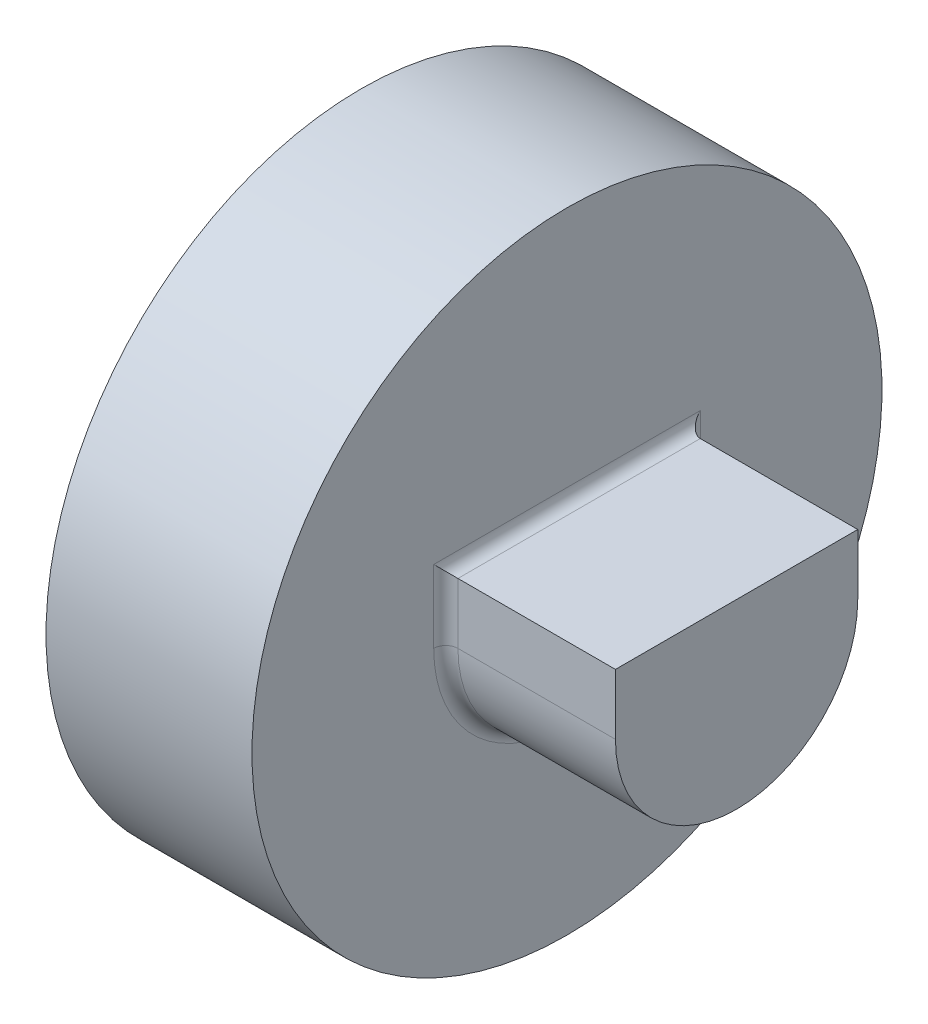
ISO-10303-21;
HEADER;
FILE_DESCRIPTION(('STEP AP214'),'2;1');
FILE_NAME('part.step','',(''),(''),'','','');
FILE_SCHEMA(('AUTOMOTIVE_DESIGN { 1 0 10303 214 1 1 1 1 }'));
ENDSEC;
DATA;
#1=APPLICATION_CONTEXT('core data for automotive mechanical design processes');
#2=APPLICATION_PROTOCOL_DEFINITION('international standard','automotive_design',2000,#1);
#3=PRODUCT_CONTEXT('',#1,'mechanical');
#4=PRODUCT('Part','Part','',(#3));
#5=PRODUCT_RELATED_PRODUCT_CATEGORY('part','',(#4));
#6=PRODUCT_DEFINITION_FORMATION('','',#4);
#7=PRODUCT_DEFINITION_CONTEXT('part definition',#1,'design');
#8=PRODUCT_DEFINITION('design','',#6,#7);
#9=PRODUCT_DEFINITION_SHAPE('','',#8);
#10=(LENGTH_UNIT() NAMED_UNIT(*) SI_UNIT(.MILLI.,.METRE.));
#11=(NAMED_UNIT(*) PLANE_ANGLE_UNIT() SI_UNIT($,.RADIAN.));
#12=(NAMED_UNIT(*) SI_UNIT($,.STERADIAN.) SOLID_ANGLE_UNIT());
#13=UNCERTAINTY_MEASURE_WITH_UNIT(LENGTH_MEASURE(1.E-05),#10,'distance_accuracy_value','');
#14=(GEOMETRIC_REPRESENTATION_CONTEXT(3) GLOBAL_UNCERTAINTY_ASSIGNED_CONTEXT((#13)) GLOBAL_UNIT_ASSIGNED_CONTEXT((#10,
#11,#12)) REPRESENTATION_CONTEXT('',''));
#15=CARTESIAN_POINT('',(0.,0.,0.));
#16=DIRECTION('',(0.,0.,1.));
#17=DIRECTION('',(1.,0.,0.));
#18=AXIS2_PLACEMENT_3D('',#15,#16,#17);
#19=CARTESIAN_POINT('',(-1.5,11.,0.));
#20=DIRECTION('',(1.,0.,0.));
#21=DIRECTION('',(0.,1.,0.));
#22=AXIS2_PLACEMENT_3D('',#19,#20,#21);
#23=PLANE('',#22);
#24=CARTESIAN_POINT('',(-1.5,0.,0.));
#25=DIRECTION('',(-1.,0.,0.));
#26=DIRECTION('',(0.,-1.,0.));
#27=AXIS2_PLACEMENT_3D('',#24,#25,#26);
#28=CIRCLE('',#27,11.);
#29=CARTESIAN_POINT('',(-1.5,-11.,0.));
#30=VERTEX_POINT('',#29);
#31=EDGE_CURVE('E199',#30,#30,#28,.T.);
#32=ORIENTED_EDGE('',*,*,#31,.T.);
#33=EDGE_LOOP('',(#32));
#34=FACE_BOUND('',#33,.T.);
#35=ADVANCED_FACE('F16',(#34),#23,.F.);
#36=CARTESIAN_POINT('',(7.,5.,0.));
#37=DIRECTION('',(-1.,0.,0.));
#38=DIRECTION('',(0.,-1.,0.));
#39=AXIS2_PLACEMENT_3D('',#36,#37,#38);
#40=PLANE('',#39);
#41=DIRECTION('',(0.,1.,0.));
#42=VECTOR('',#41,1.);
#43=CARTESIAN_POINT('',(7.,0.,-5.));
#44=LINE('',#43,#42);
#45=CARTESIAN_POINT('',(7.,2.5,-5.));
#46=VERTEX_POINT('',#45);
#47=CARTESIAN_POINT('',(7.,0.,-5.));
#48=VERTEX_POINT('',#47);
#49=EDGE_CURVE('E178',#46,#48,#44,.F.);
#50=ORIENTED_EDGE('',*,*,#49,.F.);
#51=DIRECTION('',(0.,0.,1.));
#52=VECTOR('',#51,1.);
#53=CARTESIAN_POINT('',(7.,2.5,4.33012701892219));
#54=LINE('',#53,#52);
#55=CARTESIAN_POINT('',(7.,2.5,5.));
#56=VERTEX_POINT('',#55);
#57=EDGE_CURVE('E65',#46,#56,#54,.T.);
#58=ORIENTED_EDGE('',*,*,#57,.T.);
#59=DIRECTION('',(0.,1.,0.));
#60=VECTOR('',#59,1.);
#61=CARTESIAN_POINT('',(7.,0.,5.));
#62=LINE('',#61,#60);
#63=CARTESIAN_POINT('',(7.,0.,5.));
#64=VERTEX_POINT('',#63);
#65=EDGE_CURVE('E164',#64,#56,#62,.T.);
#66=ORIENTED_EDGE('',*,*,#65,.F.);
#67=CARTESIAN_POINT('',(7.,0.,0.));
#68=DIRECTION('',(-1.,0.,0.));
#69=DIRECTION('',(0.,-1.,0.));
#70=AXIS2_PLACEMENT_3D('',#67,#68,#69);
#71=CIRCLE('',#70,5.);
#72=EDGE_CURVE('E58',#48,#64,#71,.T.);
#73=ORIENTED_EDGE('',*,*,#72,.F.);
#74=EDGE_LOOP('',(#50,#58,#66,#73));
#75=FACE_BOUND('',#74,.T.);
#76=ADVANCED_FACE('F208',(#75),#40,.F.);
#77=CARTESIAN_POINT('',(-1.5,0.,0.));
#78=DIRECTION('',(-1.,0.,0.));
#79=DIRECTION('',(0.,-1.,0.));
#80=AXIS2_PLACEMENT_3D('',#77,#78,#79);
#81=CYLINDRICAL_SURFACE('',#80,11.);
#82=ORIENTED_EDGE('',*,*,#31,.F.);
#83=EDGE_LOOP('',(#82));
#84=FACE_BOUND('',#83,.T.);
#85=CARTESIAN_POINT('',(-8.5,0.,0.));
#86=DIRECTION('',(-1.,0.,0.));
#87=DIRECTION('',(0.,-1.,0.));
#88=AXIS2_PLACEMENT_3D('',#85,#86,#87);
#89=CIRCLE('',#88,11.);
#90=CARTESIAN_POINT('',(-8.5,-11.,0.));
#91=VERTEX_POINT('',#90);
#92=EDGE_CURVE('E172',#91,#91,#89,.T.);
#93=ORIENTED_EDGE('',*,*,#92,.T.);
#94=EDGE_LOOP('',(#93));
#95=FACE_BOUND('',#94,.T.);
#96=ADVANCED_FACE('F204',(#84,#95),#81,.F.);
#97=CARTESIAN_POINT('',(-1.5,0.,0.));
#98=DIRECTION('',(-1.,0.,0.));
#99=DIRECTION('',(0.,-1.,0.));
#100=AXIS2_PLACEMENT_3D('',#97,#98,#99);
#101=CYLINDRICAL_SURFACE('',#100,5.);
#102=CARTESIAN_POINT('',(0.500000000000001,0.,0.));
#103=DIRECTION('',(-1.,0.,0.));
#104=DIRECTION('',(0.,-1.,0.));
#105=AXIS2_PLACEMENT_3D('',#102,#103,#104);
#106=CIRCLE('',#105,5.);
#107=CARTESIAN_POINT('',(0.500000000000002,0.,5.));
#108=VERTEX_POINT('',#107);
#109=CARTESIAN_POINT('',(0.500000000000001,0.,-5.));
#110=VERTEX_POINT('',#109);
#111=EDGE_CURVE('E97',#108,#110,#106,.F.);
#112=ORIENTED_EDGE('',*,*,#111,.T.);
#113=DIRECTION('',(-1.,0.,0.));
#114=VECTOR('',#113,1.);
#115=CARTESIAN_POINT('',(-8.502,0.,-5.));
#116=LINE('',#115,#114);
#117=EDGE_CURVE('E175',#48,#110,#116,.T.);
#118=ORIENTED_EDGE('',*,*,#117,.F.);
#119=ORIENTED_EDGE('',*,*,#72,.T.);
#120=DIRECTION('',(1.,0.,0.));
#121=VECTOR('',#120,1.);
#122=CARTESIAN_POINT('',(-8.502,0.,5.));
#123=LINE('',#122,#121);
#124=EDGE_CURVE('E158',#108,#64,#123,.T.);
#125=ORIENTED_EDGE('',*,*,#124,.F.);
#126=EDGE_LOOP('',(#112,#118,#119,#125));
#127=FACE_BOUND('',#126,.T.);
#128=ADVANCED_FACE('F207',(#127),#101,.T.);
#129=CARTESIAN_POINT('',(-8.502,0.,-5.));
#130=DIRECTION('',(0.,0.,-1.));
#131=DIRECTION('',(-1.,0.,0.));
#132=AXIS2_PLACEMENT_3D('',#129,#130,#131);
#133=PLANE('',#132);
#134=DIRECTION('',(1.,0.,0.));
#135=VECTOR('',#134,1.);
#136=CARTESIAN_POINT('',(-9.01387818865997,2.5,-5.));
#137=LINE('',#136,#135);
#138=CARTESIAN_POINT('',(0.500000000000001,2.5,-5.));
#139=VERTEX_POINT('',#138);
#140=EDGE_CURVE('E159',#139,#46,#137,.T.);
#141=ORIENTED_EDGE('',*,*,#140,.T.);
#142=ORIENTED_EDGE('',*,*,#49,.T.);
#143=ORIENTED_EDGE('',*,*,#117,.T.);
#144=DIRECTION('',(0.,1.,0.));
#145=VECTOR('',#144,1.);
#146=CARTESIAN_POINT('',(0.5,0.,-5.));
#147=LINE('',#146,#145);
#148=EDGE_CURVE('E127',#110,#139,#147,.T.);
#149=ORIENTED_EDGE('',*,*,#148,.T.);
#150=EDGE_LOOP('',(#141,#142,#143,#149));
#151=FACE_BOUND('',#150,.T.);
#152=ADVANCED_FACE('F254',(#151),#133,.T.);
#153=CARTESIAN_POINT('',(-9.01387818865997,2.5,4.33012701892219));
#154=DIRECTION('',(0.,-1.,0.));
#155=DIRECTION('',(1.,0.,0.));
#156=AXIS2_PLACEMENT_3D('',#153,#154,#155);
#157=PLANE('',#156);
#158=DIRECTION('',(0.,0.,1.));
#159=VECTOR('',#158,1.);
#160=CARTESIAN_POINT('',(0.500000000000002,2.5,0.));
#161=LINE('',#160,#159);
#162=CARTESIAN_POINT('',(0.500000000000002,2.5,5.));
#163=VERTEX_POINT('',#162);
#164=EDGE_CURVE('E123',#139,#163,#161,.T.);
#165=ORIENTED_EDGE('',*,*,#164,.T.);
#166=DIRECTION('',(1.,0.,0.));
#167=VECTOR('',#166,1.);
#168=CARTESIAN_POINT('',(-8.502,2.5,5.));
#169=LINE('',#168,#167);
#170=EDGE_CURVE('E151',#56,#163,#169,.F.);
#171=ORIENTED_EDGE('',*,*,#170,.F.);
#172=ORIENTED_EDGE('',*,*,#57,.F.);
#173=ORIENTED_EDGE('',*,*,#140,.F.);
#174=EDGE_LOOP('',(#165,#171,#172,#173));
#175=FACE_BOUND('',#174,.T.);
#176=ADVANCED_FACE('F219',(#175),#157,.F.);
#177=CARTESIAN_POINT('',(-8.502,0.,5.));
#178=DIRECTION('',(0.,0.,1.));
#179=DIRECTION('',(1.,0.,0.));
#180=AXIS2_PLACEMENT_3D('',#177,#178,#179);
#181=PLANE('',#180);
#182=ORIENTED_EDGE('',*,*,#124,.T.);
#183=ORIENTED_EDGE('',*,*,#65,.T.);
#184=ORIENTED_EDGE('',*,*,#170,.T.);
#185=DIRECTION('',(0.,-1.,0.));
#186=VECTOR('',#185,1.);
#187=CARTESIAN_POINT('',(0.500000000000003,0.,5.));
#188=LINE('',#187,#186);
#189=EDGE_CURVE('E100',#163,#108,#188,.T.);
#190=ORIENTED_EDGE('',*,*,#189,.T.);
#191=EDGE_LOOP('',(#182,#183,#184,#190));
#192=FACE_BOUND('',#191,.T.);
#193=ADVANCED_FACE('F213',(#192),#181,.T.);
#194=CARTESIAN_POINT('',(-8.5,13.,0.));
#195=DIRECTION('',(1.,0.,0.));
#196=DIRECTION('',(0.,1.,0.));
#197=AXIS2_PLACEMENT_3D('',#194,#195,#196);
#198=PLANE('',#197);
#199=CARTESIAN_POINT('',(-8.5,0.,0.));
#200=DIRECTION('',(-1.,0.,0.));
#201=DIRECTION('',(0.,-1.,0.));
#202=AXIS2_PLACEMENT_3D('',#199,#200,#201);
#203=CIRCLE('',#202,13.);
#204=CARTESIAN_POINT('',(-8.5,-13.,0.));
#205=VERTEX_POINT('',#204);
#206=EDGE_CURVE('E90',#205,#205,#203,.F.);
#207=ORIENTED_EDGE('',*,*,#206,.F.);
#208=EDGE_LOOP('',(#207));
#209=FACE_BOUND('',#208,.T.);
#210=ORIENTED_EDGE('',*,*,#92,.F.);
#211=EDGE_LOOP('',(#210));
#212=FACE_BOUND('',#211,.T.);
#213=ADVANCED_FACE('F144',(#209,#212),#198,.F.);
#214=CARTESIAN_POINT('',(0.500000000000001,0.,0.));
#215=DIRECTION('',(-1.,0.,0.));
#216=DIRECTION('',(0.,-1.,0.));
#217=AXIS2_PLACEMENT_3D('',#214,#215,#216);
#218=TOROIDAL_SURFACE('',#217,5.5,0.5);
#219=CARTESIAN_POINT('',(0.,0.,0.));
#220=DIRECTION('',(1.,0.,0.));
#221=DIRECTION('',(0.,-1.,0.));
#222=AXIS2_PLACEMENT_3D('',#219,#220,#221);
#223=CIRCLE('',#222,5.5);
#224=CARTESIAN_POINT('',(0.,-5.5,0.));
#225=VERTEX_POINT('',#224);
#226=CARTESIAN_POINT('',(0.,0.,-5.5));
#227=VERTEX_POINT('',#226);
#228=EDGE_CURVE('E87',#225,#227,#223,.T.);
#229=ORIENTED_EDGE('',*,*,#228,.T.);
#230=CARTESIAN_POINT('',(0.500000000000002,0.,-5.5));
#231=DIRECTION('',(0.,1.,0.));
#232=DIRECTION('',(-1.,0.,0.));
#233=AXIS2_PLACEMENT_3D('',#230,#231,#232);
#234=CIRCLE('',#233,0.5);
#235=EDGE_CURVE('E130',#227,#110,#234,.T.);
#236=ORIENTED_EDGE('',*,*,#235,.T.);
#237=ORIENTED_EDGE('',*,*,#111,.F.);
#238=CARTESIAN_POINT('',(0.500000000000002,0.,5.5));
#239=DIRECTION('',(0.,-1.,0.));
#240=DIRECTION('',(1.,0.,0.));
#241=AXIS2_PLACEMENT_3D('',#238,#239,#240);
#242=CIRCLE('',#241,0.5);
#243=CARTESIAN_POINT('',(0.,0.,5.5));
#244=VERTEX_POINT('',#243);
#245=EDGE_CURVE('E93',#108,#244,#242,.F.);
#246=ORIENTED_EDGE('',*,*,#245,.T.);
#247=CARTESIAN_POINT('',(0.,0.,0.));
#248=DIRECTION('',(1.,0.,0.));
#249=DIRECTION('',(0.,0.,1.));
#250=AXIS2_PLACEMENT_3D('',#247,#248,#249);
#251=CIRCLE('',#250,5.5);
#252=EDGE_CURVE('E79',#244,#225,#251,.T.);
#253=ORIENTED_EDGE('',*,*,#252,.T.);
#254=EDGE_LOOP('',(#229,#236,#237,#246,#253));
#255=FACE_BOUND('',#254,.T.);
#256=ADVANCED_FACE('F94',(#255),#218,.F.);
#257=CARTESIAN_POINT('',(0.500000000000002,0.,-5.5));
#258=DIRECTION('',(0.,1.,0.));
#259=DIRECTION('',(-1.,0.,0.));
#260=AXIS2_PLACEMENT_3D('',#257,#258,#259);
#261=CYLINDRICAL_SURFACE('',#260,0.5);
#262=DIRECTION('',(0.,-1.,0.));
#263=VECTOR('',#262,1.);
#264=CARTESIAN_POINT('',(0.,13.,-5.5));
#265=LINE('',#264,#263);
#266=CARTESIAN_POINT('',(0.,3.,-5.5));
#267=VERTEX_POINT('',#266);
#268=EDGE_CURVE('E105',#227,#267,#265,.F.);
#269=ORIENTED_EDGE('',*,*,#268,.T.);
#270=CARTESIAN_POINT('',(0.500000000000001,3.,-5.5));
#271=DIRECTION('',(0.,0.707106781186547,0.707106781186547));
#272=DIRECTION('',(0.,0.707106781186547,-0.707106781186547));
#273=AXIS2_PLACEMENT_3D('',#270,#271,#272);
#274=ELLIPSE('',#273,0.707106781186547,0.5);
#275=EDGE_CURVE('E126',#267,#139,#274,.T.);
#276=ORIENTED_EDGE('',*,*,#275,.T.);
#277=ORIENTED_EDGE('',*,*,#148,.F.);
#278=ORIENTED_EDGE('',*,*,#235,.F.);
#279=EDGE_LOOP('',(#269,#276,#277,#278));
#280=FACE_BOUND('',#279,.T.);
#281=ADVANCED_FACE('F143',(#280),#261,.F.);
#282=CARTESIAN_POINT('',(0.500000000000001,3.,0.));
#283=DIRECTION('',(0.,0.,1.));
#284=DIRECTION('',(1.,0.,0.));
#285=AXIS2_PLACEMENT_3D('',#282,#283,#284);
#286=CYLINDRICAL_SURFACE('',#285,0.5);
#287=ORIENTED_EDGE('',*,*,#164,.F.);
#288=ORIENTED_EDGE('',*,*,#275,.F.);
#289=DIRECTION('',(0.,0.,1.));
#290=VECTOR('',#289,1.);
#291=CARTESIAN_POINT('',(0.,3.,0.));
#292=LINE('',#291,#290);
#293=CARTESIAN_POINT('',(0.,3.,5.5));
#294=VERTEX_POINT('',#293);
#295=EDGE_CURVE('E103',#267,#294,#292,.T.);
#296=ORIENTED_EDGE('',*,*,#295,.T.);
#297=CARTESIAN_POINT('',(0.500000000000001,3.,5.5));
#298=DIRECTION('',(0.,-0.707106781186547,0.707106781186547));
#299=DIRECTION('',(0.,0.707106781186547,0.707106781186547));
#300=AXIS2_PLACEMENT_3D('',#297,#298,#299);
#301=ELLIPSE('',#300,0.707106781186547,0.5);
#302=EDGE_CURVE('E36',#294,#163,#301,.T.);
#303=ORIENTED_EDGE('',*,*,#302,.T.);
#304=EDGE_LOOP('',(#287,#288,#296,#303));
#305=FACE_BOUND('',#304,.T.);
#306=ADVANCED_FACE('F242',(#305),#286,.F.);
#307=CARTESIAN_POINT('',(0.500000000000002,0.,5.5));
#308=DIRECTION('',(0.,-1.,0.));
#309=DIRECTION('',(1.,0.,0.));
#310=AXIS2_PLACEMENT_3D('',#307,#308,#309);
#311=CYLINDRICAL_SURFACE('',#310,0.5);
#312=ORIENTED_EDGE('',*,*,#189,.F.);
#313=ORIENTED_EDGE('',*,*,#302,.F.);
#314=DIRECTION('',(0.,-1.,0.));
#315=VECTOR('',#314,1.);
#316=CARTESIAN_POINT('',(0.,13.,5.5));
#317=LINE('',#316,#315);
#318=EDGE_CURVE('E27',#294,#244,#317,.T.);
#319=ORIENTED_EDGE('',*,*,#318,.T.);
#320=ORIENTED_EDGE('',*,*,#245,.F.);
#321=EDGE_LOOP('',(#312,#313,#319,#320));
#322=FACE_BOUND('',#321,.T.);
#323=ADVANCED_FACE('F102',(#322),#311,.F.);
#324=CARTESIAN_POINT('',(-1.5,0.,0.));
#325=DIRECTION('',(-1.,0.,0.));
#326=DIRECTION('',(0.,-1.,0.));
#327=AXIS2_PLACEMENT_3D('',#324,#325,#326);
#328=CYLINDRICAL_SURFACE('',#327,13.);
#329=ORIENTED_EDGE('',*,*,#206,.T.);
#330=EDGE_LOOP('',(#329));
#331=FACE_BOUND('',#330,.T.);
#332=CARTESIAN_POINT('',(0.,0.,0.));
#333=DIRECTION('',(-1.,0.,0.));
#334=DIRECTION('',(0.,-1.,0.));
#335=AXIS2_PLACEMENT_3D('',#332,#333,#334);
#336=CIRCLE('',#335,13.);
#337=CARTESIAN_POINT('',(0.,-13.,0.));
#338=VERTEX_POINT('',#337);
#339=EDGE_CURVE('E11',#338,#338,#336,.T.);
#340=ORIENTED_EDGE('',*,*,#339,.T.);
#341=EDGE_LOOP('',(#340));
#342=FACE_BOUND('',#341,.T.);
#343=ADVANCED_FACE('F223',(#331,#342),#328,.T.);
#344=CARTESIAN_POINT('',(0.,13.,0.));
#345=DIRECTION('',(-1.,0.,0.));
#346=DIRECTION('',(0.,-1.,0.));
#347=AXIS2_PLACEMENT_3D('',#344,#345,#346);
#348=PLANE('',#347);
#349=ORIENTED_EDGE('',*,*,#339,.F.);
#350=EDGE_LOOP('',(#349));
#351=FACE_BOUND('',#350,.T.);
#352=ORIENTED_EDGE('',*,*,#295,.F.);
#353=ORIENTED_EDGE('',*,*,#268,.F.);
#354=ORIENTED_EDGE('',*,*,#228,.F.);
#355=ORIENTED_EDGE('',*,*,#252,.F.);
#356=ORIENTED_EDGE('',*,*,#318,.F.);
#357=EDGE_LOOP('',(#352,#353,#354,#355,#356));
#358=FACE_BOUND('',#357,.T.);
#359=ADVANCED_FACE('F83',(#351,#358),#348,.F.);
#360=CLOSED_SHELL('',(#35,#76,#96,#128,#152,#176,#193,#213,#256,#281,#306,#323,#343,#359));
#361=MANIFOLD_SOLID_BREP('B1',#360);
#362=ADVANCED_BREP_SHAPE_REPRESENTATION('',(#18,#361),#14);
#363=SHAPE_DEFINITION_REPRESENTATION(#9,#362);
ENDSEC;
END-ISO-10303-21;
